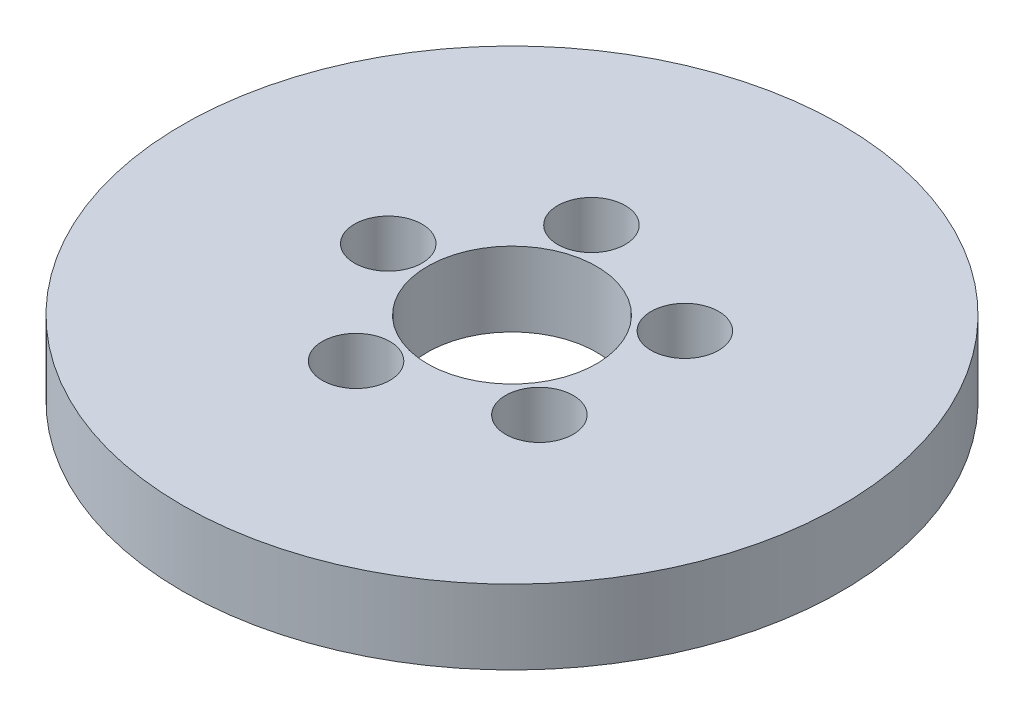
ISO-10303-21;
HEADER;
FILE_DESCRIPTION(('STEP AP214'),'2;1');
FILE_NAME('part.step','',(''),(''),'','','');
FILE_SCHEMA(('AUTOMOTIVE_DESIGN { 1 0 10303 214 1 1 1 1 }'));
ENDSEC;
DATA;
#1=APPLICATION_CONTEXT('core data for automotive mechanical design processes');
#2=APPLICATION_PROTOCOL_DEFINITION('international standard','automotive_design',2000,#1);
#3=PRODUCT_CONTEXT('',#1,'mechanical');
#4=PRODUCT('Part','Part','',(#3));
#5=PRODUCT_RELATED_PRODUCT_CATEGORY('part','',(#4));
#6=PRODUCT_DEFINITION_FORMATION('','',#4);
#7=PRODUCT_DEFINITION_CONTEXT('part definition',#1,'design');
#8=PRODUCT_DEFINITION('design','',#6,#7);
#9=PRODUCT_DEFINITION_SHAPE('','',#8);
#10=(LENGTH_UNIT() NAMED_UNIT(*) SI_UNIT(.MILLI.,.METRE.));
#11=(NAMED_UNIT(*) PLANE_ANGLE_UNIT() SI_UNIT($,.RADIAN.));
#12=(NAMED_UNIT(*) SI_UNIT($,.STERADIAN.) SOLID_ANGLE_UNIT());
#13=UNCERTAINTY_MEASURE_WITH_UNIT(LENGTH_MEASURE(1.E-05),#10,'distance_accuracy_value','');
#14=(GEOMETRIC_REPRESENTATION_CONTEXT(3) GLOBAL_UNCERTAINTY_ASSIGNED_CONTEXT((#13)) GLOBAL_UNIT_ASSIGNED_CONTEXT((#10,
#11,#12)) REPRESENTATION_CONTEXT('',''));
#15=CARTESIAN_POINT('',(0.,0.,0.));
#16=DIRECTION('',(0.,0.,1.));
#17=DIRECTION('',(1.,0.,0.));
#18=AXIS2_PLACEMENT_3D('',#15,#16,#17);
#19=CARTESIAN_POINT('',(0.,22.,0.));
#20=DIRECTION('',(0.,-1.,0.));
#21=DIRECTION('',(0.,0.,-1.));
#22=AXIS2_PLACEMENT_3D('',#19,#20,#21);
#23=CYLINDRICAL_SURFACE('',#22,97.5);
#24=CARTESIAN_POINT('',(0.,22.,0.));
#25=DIRECTION('',(0.,1.,0.));
#26=DIRECTION('',(0.,0.,1.));
#27=AXIS2_PLACEMENT_3D('',#24,#25,#26);
#28=CIRCLE('',#27,97.5);
#29=CARTESIAN_POINT('',(0.,22.,97.5));
#30=VERTEX_POINT('',#29);
#31=EDGE_CURVE('E10',#30,#30,#28,.T.);
#32=ORIENTED_EDGE('',*,*,#31,.F.);
#33=EDGE_LOOP('',(#32));
#34=FACE_BOUND('',#33,.T.);
#35=CARTESIAN_POINT('',(0.,0.,0.));
#36=DIRECTION('',(0.,1.,0.));
#37=DIRECTION('',(0.,0.,1.));
#38=AXIS2_PLACEMENT_3D('',#35,#36,#37);
#39=CIRCLE('',#38,97.5);
#40=CARTESIAN_POINT('',(0.,0.,97.5));
#41=VERTEX_POINT('',#40);
#42=EDGE_CURVE('E37',#41,#41,#39,.T.);
#43=ORIENTED_EDGE('',*,*,#42,.T.);
#44=EDGE_LOOP('',(#43));
#45=FACE_BOUND('',#44,.T.);
#46=ADVANCED_FACE('F40',(#34,#45),#23,.T.);
#47=CARTESIAN_POINT('',(0.,22.,0.));
#48=DIRECTION('',(0.,1.,0.));
#49=DIRECTION('',(0.,0.,1.));
#50=AXIS2_PLACEMENT_3D('',#47,#48,#49);
#51=PLANE('',#50);
#52=CARTESIAN_POINT('',(-11.3145147797956,22.,-34.8224958689017));
#53=DIRECTION('',(0.,1.,0.));
#54=DIRECTION('',(-0.95105651629515,0.,0.309016994374958));
#55=AXIS2_PLACEMENT_3D('',#52,#53,#54);
#56=CIRCLE('',#55,10.);
#57=CARTESIAN_POINT('',(-20.8250799427471,22.,-31.7323259251522));
#58=VERTEX_POINT('',#57);
#59=EDGE_CURVE('E70',#58,#58,#56,.T.);
#60=ORIENTED_EDGE('',*,*,#59,.F.);
#61=EDGE_LOOP('',(#60));
#62=FACE_BOUND('',#61,.T.);
#63=CARTESIAN_POINT('',(29.6217842597168,22.,-21.5214860200844));
#64=DIRECTION('',(0.,1.,0.));
#65=DIRECTION('',(-0.58778525229248,0.,-0.809016994374942));
#66=AXIS2_PLACEMENT_3D('',#63,#64,#65);
#67=CIRCLE('',#66,10.);
#68=CARTESIAN_POINT('',(23.743931736792,22.,-29.6116559638338));
#69=VERTEX_POINT('',#68);
#70=EDGE_CURVE('E71',#69,#69,#67,.T.);
#71=ORIENTED_EDGE('',*,*,#70,.F.);
#72=EDGE_LOOP('',(#71));
#73=FACE_BOUND('',#72,.T.);
#74=CARTESIAN_POINT('',(29.6217842597171,22.,21.521486020084));
#75=DIRECTION('',(0.,1.,0.));
#76=DIRECTION('',(0.587785252292469,0.,-0.809016994374951));
#77=AXIS2_PLACEMENT_3D('',#74,#75,#76);
#78=CIRCLE('',#77,10.);
#79=CARTESIAN_POINT('',(35.4996367826418,22.,13.4313160763345));
#80=VERTEX_POINT('',#79);
#81=EDGE_CURVE('E78',#80,#80,#78,.T.);
#82=ORIENTED_EDGE('',*,*,#81,.F.);
#83=EDGE_LOOP('',(#82));
#84=FACE_BOUND('',#83,.T.);
#85=CARTESIAN_POINT('',(-11.3145147797951,22.,34.8224958689019));
#86=DIRECTION('',(0.,1.,0.));
#87=DIRECTION('',(0.951056516295155,0.,0.309016994374945));
#88=AXIS2_PLACEMENT_3D('',#85,#86,#87);
#89=CIRCLE('',#88,10.);
#90=CARTESIAN_POINT('',(-1.80394961684359,22.,37.9126658126514));
#91=VERTEX_POINT('',#90);
#92=EDGE_CURVE('E61',#91,#91,#89,.T.);
#93=ORIENTED_EDGE('',*,*,#92,.F.);
#94=EDGE_LOOP('',(#93));
#95=FACE_BOUND('',#94,.T.);
#96=CARTESIAN_POINT('',(-36.6145389598434,22.,0.));
#97=DIRECTION('',(0.,1.,0.));
#98=DIRECTION('',(0.,0.,1.));
#99=AXIS2_PLACEMENT_3D('',#96,#97,#98);
#100=CIRCLE('',#99,10.);
#101=CARTESIAN_POINT('',(-36.6145389598434,22.,10.));
#102=VERTEX_POINT('',#101);
#103=EDGE_CURVE('E54',#102,#102,#100,.T.);
#104=ORIENTED_EDGE('',*,*,#103,.F.);
#105=EDGE_LOOP('',(#104));
#106=FACE_BOUND('',#105,.T.);
#107=CARTESIAN_POINT('',(0.,22.,0.));
#108=DIRECTION('',(0.,1.,0.));
#109=DIRECTION('',(0.,0.,1.));
#110=AXIS2_PLACEMENT_3D('',#107,#108,#109);
#111=CIRCLE('',#110,25.);
#112=CARTESIAN_POINT('',(0.,22.,25.));
#113=VERTEX_POINT('',#112);
#114=EDGE_CURVE('E50',#113,#113,#111,.T.);
#115=ORIENTED_EDGE('',*,*,#114,.F.);
#116=EDGE_LOOP('',(#115));
#117=FACE_BOUND('',#116,.T.);
#118=ORIENTED_EDGE('',*,*,#31,.T.);
#119=EDGE_LOOP('',(#118));
#120=FACE_BOUND('',#119,.T.);
#121=ADVANCED_FACE('F94',(#62,#73,#84,#95,#106,#117,#120),#51,.T.);
#122=CARTESIAN_POINT('',(0.,0.,0.));
#123=DIRECTION('',(0.,1.,0.));
#124=DIRECTION('',(0.,0.,1.));
#125=AXIS2_PLACEMENT_3D('',#122,#123,#124);
#126=PLANE('',#125);
#127=CARTESIAN_POINT('',(0.,0.,0.));
#128=DIRECTION('',(0.,1.,0.));
#129=DIRECTION('',(0.,0.,1.));
#130=AXIS2_PLACEMENT_3D('',#127,#128,#129);
#131=CIRCLE('',#130,25.);
#132=CARTESIAN_POINT('',(0.,0.,25.));
#133=VERTEX_POINT('',#132);
#134=EDGE_CURVE('E47',#133,#133,#131,.T.);
#135=ORIENTED_EDGE('',*,*,#134,.T.);
#136=EDGE_LOOP('',(#135));
#137=FACE_BOUND('',#136,.T.);
#138=ORIENTED_EDGE('',*,*,#42,.F.);
#139=EDGE_LOOP('',(#138));
#140=FACE_BOUND('',#139,.T.);
#141=ADVANCED_FACE('F100',(#137,#140),#126,.F.);
#142=CARTESIAN_POINT('',(0.,22.,0.));
#143=DIRECTION('',(0.,-1.,0.));
#144=DIRECTION('',(0.,0.,-1.));
#145=AXIS2_PLACEMENT_3D('',#142,#143,#144);
#146=CYLINDRICAL_SURFACE('',#145,25.);
#147=ORIENTED_EDGE('',*,*,#114,.T.);
#148=EDGE_LOOP('',(#147));
#149=FACE_BOUND('',#148,.T.);
#150=ORIENTED_EDGE('',*,*,#134,.F.);
#151=EDGE_LOOP('',(#150));
#152=FACE_BOUND('',#151,.T.);
#153=ADVANCED_FACE('F106',(#149,#152),#146,.F.);
#154=CARTESIAN_POINT('',(-36.6145389598434,5.72993983096233,0.));
#155=DIRECTION('',(0.,1.,0.));
#156=DIRECTION('',(0.,0.,1.));
#157=AXIS2_PLACEMENT_3D('',#154,#155,#156);
#158=CYLINDRICAL_SURFACE('',#157,10.);
#159=CARTESIAN_POINT('',(-36.6145389598434,5.72993983096233,0.));
#160=DIRECTION('',(0.,1.,0.));
#161=DIRECTION('',(0.,0.,1.));
#162=AXIS2_PLACEMENT_3D('',#159,#160,#161);
#163=CIRCLE('',#162,10.);
#164=CARTESIAN_POINT('',(-36.6145389598434,5.72993983096233,10.));
#165=VERTEX_POINT('',#164);
#166=EDGE_CURVE('E55',#165,#165,#163,.T.);
#167=ORIENTED_EDGE('',*,*,#166,.F.);
#168=EDGE_LOOP('',(#167));
#169=FACE_BOUND('',#168,.T.);
#170=ORIENTED_EDGE('',*,*,#103,.T.);
#171=EDGE_LOOP('',(#170));
#172=FACE_BOUND('',#171,.T.);
#173=ADVANCED_FACE('F108',(#169,#172),#158,.F.);
#174=CARTESIAN_POINT('',(-36.6145389598434,5.72993983096233,0.));
#175=DIRECTION('',(0.,1.,0.));
#176=DIRECTION('',(0.,0.,1.));
#177=AXIS2_PLACEMENT_3D('',#174,#175,#176);
#178=PLANE('',#177);
#179=ORIENTED_EDGE('',*,*,#166,.T.);
#180=EDGE_LOOP('',(#179));
#181=FACE_BOUND('',#180,.T.);
#182=ADVANCED_FACE('F138',(#181),#178,.T.);
#183=CARTESIAN_POINT('',(-11.3145147797951,5.72993983096233,34.8224958689019));
#184=DIRECTION('',(0.,1.,0.));
#185=DIRECTION('',(0.,0.,1.));
#186=AXIS2_PLACEMENT_3D('',#183,#184,#185);
#187=CYLINDRICAL_SURFACE('',#186,10.);
#188=CARTESIAN_POINT('',(-11.3145147797951,5.72993983096233,34.8224958689019));
#189=DIRECTION('',(0.,1.,0.));
#190=DIRECTION('',(0.951056516295155,0.,0.309016994374945));
#191=AXIS2_PLACEMENT_3D('',#188,#189,#190);
#192=CIRCLE('',#191,10.);
#193=CARTESIAN_POINT('',(-1.80394961684359,5.72993983096233,37.9126658126514));
#194=VERTEX_POINT('',#193);
#195=EDGE_CURVE('E59',#194,#194,#192,.T.);
#196=ORIENTED_EDGE('',*,*,#195,.F.);
#197=EDGE_LOOP('',(#196));
#198=FACE_BOUND('',#197,.T.);
#199=ORIENTED_EDGE('',*,*,#92,.T.);
#200=EDGE_LOOP('',(#199));
#201=FACE_BOUND('',#200,.T.);
#202=ADVANCED_FACE('F150',(#198,#201),#187,.F.);
#203=CARTESIAN_POINT('',(-11.3145147797951,5.72993983096233,34.8224958689019));
#204=DIRECTION('',(0.,1.,0.));
#205=DIRECTION('',(0.951056516295155,0.,0.309016994374945));
#206=AXIS2_PLACEMENT_3D('',#203,#204,#205);
#207=PLANE('',#206);
#208=ORIENTED_EDGE('',*,*,#195,.T.);
#209=EDGE_LOOP('',(#208));
#210=FACE_BOUND('',#209,.T.);
#211=ADVANCED_FACE('F89',(#210),#207,.T.);
#212=CARTESIAN_POINT('',(29.6217842597171,5.72993983096233,21.521486020084));
#213=DIRECTION('',(0.,1.,0.));
#214=DIRECTION('',(0.,0.,1.));
#215=AXIS2_PLACEMENT_3D('',#212,#213,#214);
#216=CYLINDRICAL_SURFACE('',#215,10.);
#217=CARTESIAN_POINT('',(29.6217842597171,5.72993983096233,21.521486020084));
#218=DIRECTION('',(0.,1.,0.));
#219=DIRECTION('',(0.587785252292469,0.,-0.809016994374951));
#220=AXIS2_PLACEMENT_3D('',#217,#218,#219);
#221=CIRCLE('',#220,10.);
#222=CARTESIAN_POINT('',(35.4996367826418,5.72993983096233,13.4313160763345));
#223=VERTEX_POINT('',#222);
#224=EDGE_CURVE('E63',#223,#223,#221,.T.);
#225=ORIENTED_EDGE('',*,*,#224,.F.);
#226=EDGE_LOOP('',(#225));
#227=FACE_BOUND('',#226,.T.);
#228=ORIENTED_EDGE('',*,*,#81,.T.);
#229=EDGE_LOOP('',(#228));
#230=FACE_BOUND('',#229,.T.);
#231=ADVANCED_FACE('F87',(#227,#230),#216,.F.);
#232=CARTESIAN_POINT('',(29.6217842597171,5.72993983096233,21.521486020084));
#233=DIRECTION('',(0.,1.,0.));
#234=DIRECTION('',(0.587785252292469,0.,-0.809016994374951));
#235=AXIS2_PLACEMENT_3D('',#232,#233,#234);
#236=PLANE('',#235);
#237=ORIENTED_EDGE('',*,*,#224,.T.);
#238=EDGE_LOOP('',(#237));
#239=FACE_BOUND('',#238,.T.);
#240=ADVANCED_FACE('F84',(#239),#236,.T.);
#241=CARTESIAN_POINT('',(29.6217842597168,5.72993983096233,-21.5214860200844));
#242=DIRECTION('',(0.,1.,0.));
#243=DIRECTION('',(0.,0.,1.));
#244=AXIS2_PLACEMENT_3D('',#241,#242,#243);
#245=CYLINDRICAL_SURFACE('',#244,10.);
#246=CARTESIAN_POINT('',(29.6217842597168,5.72993983096233,-21.5214860200844));
#247=DIRECTION('',(0.,1.,0.));
#248=DIRECTION('',(-0.58778525229248,0.,-0.809016994374942));
#249=AXIS2_PLACEMENT_3D('',#246,#247,#248);
#250=CIRCLE('',#249,10.);
#251=CARTESIAN_POINT('',(23.743931736792,5.72993983096233,-29.6116559638338));
#252=VERTEX_POINT('',#251);
#253=EDGE_CURVE('E76',#252,#252,#250,.T.);
#254=ORIENTED_EDGE('',*,*,#253,.F.);
#255=EDGE_LOOP('',(#254));
#256=FACE_BOUND('',#255,.T.);
#257=ORIENTED_EDGE('',*,*,#70,.T.);
#258=EDGE_LOOP('',(#257));
#259=FACE_BOUND('',#258,.T.);
#260=ADVANCED_FACE('F185',(#256,#259),#245,.F.);
#261=CARTESIAN_POINT('',(29.6217842597168,5.72993983096233,-21.5214860200844));
#262=DIRECTION('',(0.,1.,0.));
#263=DIRECTION('',(-0.58778525229248,0.,-0.809016994374942));
#264=AXIS2_PLACEMENT_3D('',#261,#262,#263);
#265=PLANE('',#264);
#266=ORIENTED_EDGE('',*,*,#253,.T.);
#267=EDGE_LOOP('',(#266));
#268=FACE_BOUND('',#267,.T.);
#269=ADVANCED_FACE('F189',(#268),#265,.T.);
#270=CARTESIAN_POINT('',(-11.3145147797956,5.72993983096233,-34.8224958689017));
#271=DIRECTION('',(0.,1.,0.));
#272=DIRECTION('',(0.,0.,1.));
#273=AXIS2_PLACEMENT_3D('',#270,#271,#272);
#274=CYLINDRICAL_SURFACE('',#273,10.);
#275=CARTESIAN_POINT('',(-11.3145147797956,5.72993983096233,-34.8224958689017));
#276=DIRECTION('',(0.,1.,0.));
#277=DIRECTION('',(-0.95105651629515,0.,0.309016994374958));
#278=AXIS2_PLACEMENT_3D('',#275,#276,#277);
#279=CIRCLE('',#278,10.);
#280=CARTESIAN_POINT('',(-20.8250799427471,5.72993983096233,-31.7323259251522));
#281=VERTEX_POINT('',#280);
#282=EDGE_CURVE('E69',#281,#281,#279,.T.);
#283=ORIENTED_EDGE('',*,*,#282,.F.);
#284=EDGE_LOOP('',(#283));
#285=FACE_BOUND('',#284,.T.);
#286=ORIENTED_EDGE('',*,*,#59,.T.);
#287=EDGE_LOOP('',(#286));
#288=FACE_BOUND('',#287,.T.);
#289=ADVANCED_FACE('F200',(#285,#288),#274,.F.);
#290=CARTESIAN_POINT('',(-11.3145147797956,5.72993983096233,-34.8224958689017));
#291=DIRECTION('',(0.,1.,0.));
#292=DIRECTION('',(-0.95105651629515,0.,0.309016994374958));
#293=AXIS2_PLACEMENT_3D('',#290,#291,#292);
#294=PLANE('',#293);
#295=ORIENTED_EDGE('',*,*,#282,.T.);
#296=EDGE_LOOP('',(#295));
#297=FACE_BOUND('',#296,.T.);
#298=ADVANCED_FACE('F208',(#297),#294,.T.);
#299=CLOSED_SHELL('',(#46,#121,#141,#153,#173,#182,#202,#211,#231,#240,#260,#269,#289,#298));
#300=MANIFOLD_SOLID_BREP('B2',#299);
#301=ADVANCED_BREP_SHAPE_REPRESENTATION('',(#18,#300),#14);
#302=SHAPE_DEFINITION_REPRESENTATION(#9,#301);
ENDSEC;
END-ISO-10303-21;
